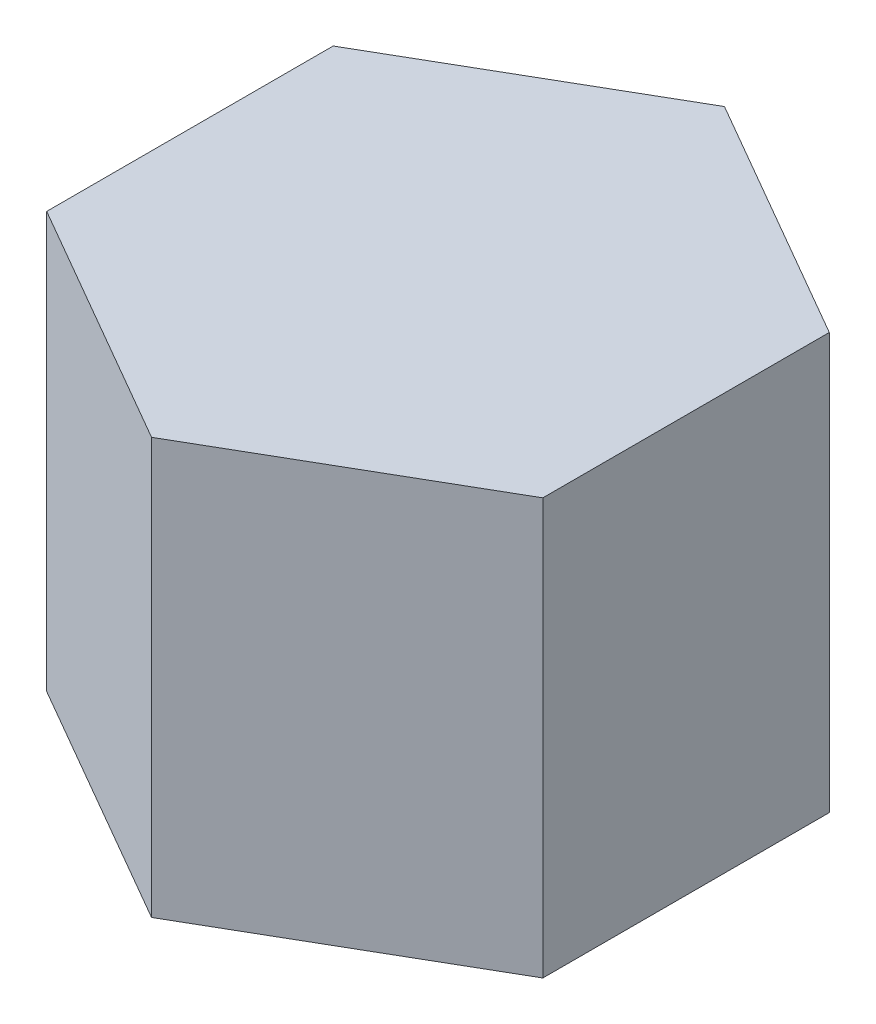
ISO-10303-21;
HEADER;
FILE_DESCRIPTION(('STEP AP214'),'2;1');
FILE_NAME('part.step','',(''),(''),'','','');
FILE_SCHEMA(('AUTOMOTIVE_DESIGN { 1 0 10303 214 1 1 1 1 }'));
ENDSEC;
DATA;
#1=APPLICATION_CONTEXT('core data for automotive mechanical design processes');
#2=APPLICATION_PROTOCOL_DEFINITION('international standard','automotive_design',2000,#1);
#3=PRODUCT_CONTEXT('',#1,'mechanical');
#4=PRODUCT('Part','Part','',(#3));
#5=PRODUCT_RELATED_PRODUCT_CATEGORY('part','',(#4));
#6=PRODUCT_DEFINITION_FORMATION('','',#4);
#7=PRODUCT_DEFINITION_CONTEXT('part definition',#1,'design');
#8=PRODUCT_DEFINITION('design','',#6,#7);
#9=PRODUCT_DEFINITION_SHAPE('','',#8);
#10=(LENGTH_UNIT() NAMED_UNIT(*) SI_UNIT(.MILLI.,.METRE.));
#11=(NAMED_UNIT(*) PLANE_ANGLE_UNIT() SI_UNIT($,.RADIAN.));
#12=(NAMED_UNIT(*) SI_UNIT($,.STERADIAN.) SOLID_ANGLE_UNIT());
#13=UNCERTAINTY_MEASURE_WITH_UNIT(LENGTH_MEASURE(1.E-05),#10,'distance_accuracy_value','');
#14=(GEOMETRIC_REPRESENTATION_CONTEXT(3) GLOBAL_UNCERTAINTY_ASSIGNED_CONTEXT((#13)) GLOBAL_UNIT_ASSIGNED_CONTEXT((#10,
#11,#12)) REPRESENTATION_CONTEXT('',''));
#15=CARTESIAN_POINT('',(0.,0.,0.));
#16=DIRECTION('',(0.,0.,1.));
#17=DIRECTION('',(1.,0.,0.));
#18=AXIS2_PLACEMENT_3D('',#15,#16,#17);
#19=CARTESIAN_POINT('',(202.142660308706,-148.537700895744,288.908895009141));
#20=DIRECTION('',(-0.499999999999943,0.,-0.866025403784472));
#21=DIRECTION('',(-0.866025403784472,0.,0.499999999999943));
#22=AXIS2_PLACEMENT_3D('',#19,#20,#21);
#23=PLANE('',#22);
#24=CARTESIAN_POINT('',(201.839551417382,-149.045793579175,289.083895009141));
#25=DIRECTION('',(0.866025403784471,0.,-0.499999999999943));
#26=VECTOR('',#25,1.);
#27=LINE('',#24,#26);
#28=CARTESIAN_POINT('',(201.839551417382,-149.045793579175,289.083895009141));
#29=VERTEX_POINT('',#28);
#30=CARTESIAN_POINT('',(202.142660308706,-149.045793579175,288.908895009141));
#31=VERTEX_POINT('',#30);
#32=EDGE_CURVE('E170',#29,#31,#27,.T.);
#33=ORIENTED_EDGE('',*,*,#32,.T.);
#34=CARTESIAN_POINT('',(202.142660308706,-148.537700895744,288.908895009141));
#35=DIRECTION('',(0.,-1.,0.));
#36=VECTOR('',#35,1.);
#37=LINE('',#34,#36);
#38=CARTESIAN_POINT('',(202.142660308706,-148.537700895744,288.908895009141));
#39=VERTEX_POINT('',#38);
#40=EDGE_CURVE('E35',#39,#31,#37,.T.);
#41=ORIENTED_EDGE('',*,*,#40,.F.);
#42=CARTESIAN_POINT('',(201.839551417382,-148.537700895744,289.083895009141));
#43=DIRECTION('',(0.866025403784471,0.,-0.499999999999943));
#44=VECTOR('',#43,1.);
#45=LINE('',#42,#44);
#46=CARTESIAN_POINT('',(201.839551417382,-148.537700895744,289.083895009141));
#47=VERTEX_POINT('',#46);
#48=EDGE_CURVE('E159',#47,#39,#45,.T.);
#49=ORIENTED_EDGE('',*,*,#48,.F.);
#50=CARTESIAN_POINT('',(201.839551417382,-148.537700895744,289.083895009141));
#51=DIRECTION('',(0.,-1.,0.));
#52=VECTOR('',#51,1.);
#53=LINE('',#50,#52);
#54=EDGE_CURVE('E10',#47,#29,#53,.T.);
#55=ORIENTED_EDGE('',*,*,#54,.T.);
#56=EDGE_LOOP('',(#33,#41,#49,#55));
#57=FACE_BOUND('',#56,.T.);
#58=ADVANCED_FACE('F16',(#57),#23,.F.);
#59=CARTESIAN_POINT('',(201.839551417382,-148.537700895744,289.083895009141));
#60=DIRECTION('',(0.500000000000062,0.,-0.866025403784403));
#61=DIRECTION('',(-0.866025403784403,0.,-0.500000000000062));
#62=AXIS2_PLACEMENT_3D('',#59,#60,#61);
#63=PLANE('',#62);
#64=CARTESIAN_POINT('',(201.536442526057,-149.045793579175,288.908895009141));
#65=DIRECTION('',(0.866025403784403,0.,0.500000000000062));
#66=VECTOR('',#65,1.);
#67=LINE('',#64,#66);
#68=CARTESIAN_POINT('',(201.536442526057,-149.045793579175,288.908895009141));
#69=VERTEX_POINT('',#68);
#70=EDGE_CURVE('E167',#69,#29,#67,.T.);
#71=ORIENTED_EDGE('',*,*,#70,.T.);
#72=ORIENTED_EDGE('',*,*,#54,.F.);
#73=CARTESIAN_POINT('',(201.536442526057,-148.537700895744,288.908895009141));
#74=DIRECTION('',(0.866025403784403,0.,0.500000000000062));
#75=VECTOR('',#74,1.);
#76=LINE('',#73,#75);
#77=CARTESIAN_POINT('',(201.536442526057,-148.537700895744,288.908895009141));
#78=VERTEX_POINT('',#77);
#79=EDGE_CURVE('E156',#78,#47,#76,.T.);
#80=ORIENTED_EDGE('',*,*,#79,.F.);
#81=CARTESIAN_POINT('',(201.536442526057,-148.537700895744,288.908895009141));
#82=DIRECTION('',(0.,-1.,0.));
#83=VECTOR('',#82,1.);
#84=LINE('',#81,#83);
#85=EDGE_CURVE('E27',#78,#69,#84,.T.);
#86=ORIENTED_EDGE('',*,*,#85,.T.);
#87=EDGE_LOOP('',(#71,#72,#80,#86));
#88=FACE_BOUND('',#87,.T.);
#89=ADVANCED_FACE('F189',(#88),#63,.F.);
#90=CARTESIAN_POINT('',(201.536442526057,-148.537700895744,290.831971220494));
#91=DIRECTION('',(1.,0.,0.));
#92=DIRECTION('',(0.,1.,0.));
#93=AXIS2_PLACEMENT_3D('',#90,#91,#92);
#94=PLANE('',#93);
#95=CARTESIAN_POINT('',(201.536442526057,-149.045793579175,288.558895009141));
#96=DIRECTION('',(0.,0.,1.));
#97=VECTOR('',#96,1.);
#98=LINE('',#95,#97);
#99=CARTESIAN_POINT('',(201.536442526057,-149.045793579175,288.558895009141));
#100=VERTEX_POINT('',#99);
#101=EDGE_CURVE('E163',#100,#69,#98,.T.);
#102=ORIENTED_EDGE('',*,*,#101,.T.);
#103=ORIENTED_EDGE('',*,*,#85,.F.);
#104=CARTESIAN_POINT('',(201.536442526057,-148.537700895744,288.558895009141));
#105=DIRECTION('',(0.,0.,1.));
#106=VECTOR('',#105,1.);
#107=LINE('',#104,#106);
#108=CARTESIAN_POINT('',(201.536442526057,-148.537700895744,288.558895009141));
#109=VERTEX_POINT('',#108);
#110=EDGE_CURVE('E106',#109,#78,#107,.T.);
#111=ORIENTED_EDGE('',*,*,#110,.F.);
#112=CARTESIAN_POINT('',(201.536442526057,-148.537700895744,288.558895009141));
#113=DIRECTION('',(0.,-1.,0.));
#114=VECTOR('',#113,1.);
#115=LINE('',#112,#114);
#116=EDGE_CURVE('E94',#109,#100,#115,.T.);
#117=ORIENTED_EDGE('',*,*,#116,.T.);
#118=EDGE_LOOP('',(#102,#103,#111,#117));
#119=FACE_BOUND('',#118,.T.);
#120=ADVANCED_FACE('F198',(#119),#94,.F.);
#121=CARTESIAN_POINT('',(201.536442526057,-148.537700895744,288.558895009141));
#122=DIRECTION('',(0.499999999999978,0.,0.866025403784452));
#123=DIRECTION('',(0.866025403784452,0.,-0.499999999999978));
#124=AXIS2_PLACEMENT_3D('',#121,#122,#123);
#125=PLANE('',#124);
#126=CARTESIAN_POINT('',(201.839551417382,-149.045793579175,288.383895009141));
#127=DIRECTION('',(-0.866025403784452,0.,0.499999999999978));
#128=VECTOR('',#127,1.);
#129=LINE('',#126,#128);
#130=CARTESIAN_POINT('',(201.839551417382,-149.045793579175,288.383895009141));
#131=VERTEX_POINT('',#130);
#132=EDGE_CURVE('E162',#131,#100,#129,.T.);
#133=ORIENTED_EDGE('',*,*,#132,.T.);
#134=ORIENTED_EDGE('',*,*,#116,.F.);
#135=CARTESIAN_POINT('',(201.839551417382,-148.537700895744,288.383895009141));
#136=DIRECTION('',(-0.866025403784452,0.,0.499999999999978));
#137=VECTOR('',#136,1.);
#138=LINE('',#135,#137);
#139=CARTESIAN_POINT('',(201.839551417382,-148.537700895744,288.383895009141));
#140=VERTEX_POINT('',#139);
#141=EDGE_CURVE('E98',#140,#109,#138,.T.);
#142=ORIENTED_EDGE('',*,*,#141,.F.);
#143=CARTESIAN_POINT('',(201.839551417382,-148.537700895744,288.383895009141));
#144=DIRECTION('',(0.,-1.,0.));
#145=VECTOR('',#144,1.);
#146=LINE('',#143,#145);
#147=EDGE_CURVE('E79',#140,#131,#146,.T.);
#148=ORIENTED_EDGE('',*,*,#147,.T.);
#149=EDGE_LOOP('',(#133,#134,#142,#148));
#150=FACE_BOUND('',#149,.T.);
#151=ADVANCED_FACE('F100',(#150),#125,.F.);
#152=CARTESIAN_POINT('',(201.839551417382,-148.537700895744,288.383895009141));
#153=DIRECTION('',(-0.499999999999978,0.,0.866025403784452));
#154=DIRECTION('',(0.866025403784452,0.,0.499999999999978));
#155=AXIS2_PLACEMENT_3D('',#152,#153,#154);
#156=PLANE('',#155);
#157=CARTESIAN_POINT('',(202.142660308706,-149.045793579175,288.558895009141));
#158=DIRECTION('',(-0.866025403784452,0.,-0.499999999999978));
#159=VECTOR('',#158,1.);
#160=LINE('',#157,#159);
#161=CARTESIAN_POINT('',(202.142660308706,-149.045793579175,288.558895009141));
#162=VERTEX_POINT('',#161);
#163=EDGE_CURVE('E88',#162,#131,#160,.T.);
#164=ORIENTED_EDGE('',*,*,#163,.T.);
#165=ORIENTED_EDGE('',*,*,#147,.F.);
#166=CARTESIAN_POINT('',(202.142660308706,-148.537700895744,288.558895009141));
#167=DIRECTION('',(-0.866025403784452,0.,-0.499999999999978));
#168=VECTOR('',#167,1.);
#169=LINE('',#166,#168);
#170=CARTESIAN_POINT('',(202.142660308706,-148.537700895744,288.558895009141));
#171=VERTEX_POINT('',#170);
#172=EDGE_CURVE('E84',#171,#140,#169,.T.);
#173=ORIENTED_EDGE('',*,*,#172,.F.);
#174=CARTESIAN_POINT('',(202.142660308706,-148.537700895744,288.558895009141));
#175=DIRECTION('',(0.,-1.,0.));
#176=VECTOR('',#175,1.);
#177=LINE('',#174,#176);
#178=EDGE_CURVE('E58',#171,#162,#177,.T.);
#179=ORIENTED_EDGE('',*,*,#178,.T.);
#180=EDGE_LOOP('',(#164,#165,#173,#179));
#181=FACE_BOUND('',#180,.T.);
#182=ADVANCED_FACE('F82',(#181),#156,.F.);
#183=CARTESIAN_POINT('',(202.142660308706,-148.537700895744,290.831971220494));
#184=DIRECTION('',(-1.,0.,0.));
#185=DIRECTION('',(0.,-1.,0.));
#186=AXIS2_PLACEMENT_3D('',#183,#184,#185);
#187=PLANE('',#186);
#188=CARTESIAN_POINT('',(202.142660308706,-149.045793579175,288.908895009141));
#189=DIRECTION('',(0.,0.,-1.));
#190=VECTOR('',#189,1.);
#191=LINE('',#188,#190);
#192=EDGE_CURVE('E160',#31,#162,#191,.T.);
#193=ORIENTED_EDGE('',*,*,#192,.T.);
#194=ORIENTED_EDGE('',*,*,#178,.F.);
#195=CARTESIAN_POINT('',(202.142660308706,-148.537700895744,288.908895009141));
#196=DIRECTION('',(0.,0.,-1.));
#197=VECTOR('',#196,1.);
#198=LINE('',#195,#197);
#199=EDGE_CURVE('E112',#39,#171,#198,.T.);
#200=ORIENTED_EDGE('',*,*,#199,.F.);
#201=ORIENTED_EDGE('',*,*,#40,.T.);
#202=EDGE_LOOP('',(#193,#194,#200,#201));
#203=FACE_BOUND('',#202,.T.);
#204=ADVANCED_FACE('F131',(#203),#187,.F.);
#205=CARTESIAN_POINT('',(206.339551417382,-148.537700895744,290.831971220494));
#206=DIRECTION('',(0.,-1.,0.));
#207=DIRECTION('',(1.,0.,0.));
#208=AXIS2_PLACEMENT_3D('',#205,#206,#207);
#209=PLANE('',#208);
#210=ORIENTED_EDGE('',*,*,#48,.T.);
#211=ORIENTED_EDGE('',*,*,#199,.T.);
#212=ORIENTED_EDGE('',*,*,#172,.T.);
#213=ORIENTED_EDGE('',*,*,#141,.T.);
#214=ORIENTED_EDGE('',*,*,#110,.T.);
#215=ORIENTED_EDGE('',*,*,#79,.T.);
#216=EDGE_LOOP('',(#210,#211,#212,#213,#214,#215));
#217=FACE_BOUND('',#216,.T.);
#218=ADVANCED_FACE('F111',(#217),#209,.F.);
#219=CARTESIAN_POINT('',(206.339551417382,-149.045793579175,290.831971220494));
#220=DIRECTION('',(0.,-1.,0.));
#221=DIRECTION('',(1.,0.,0.));
#222=AXIS2_PLACEMENT_3D('',#219,#220,#221);
#223=PLANE('',#222);
#224=ORIENTED_EDGE('',*,*,#32,.F.);
#225=ORIENTED_EDGE('',*,*,#70,.F.);
#226=ORIENTED_EDGE('',*,*,#101,.F.);
#227=ORIENTED_EDGE('',*,*,#132,.F.);
#228=ORIENTED_EDGE('',*,*,#163,.F.);
#229=ORIENTED_EDGE('',*,*,#192,.F.);
#230=EDGE_LOOP('',(#224,#225,#226,#227,#228,#229));
#231=FACE_BOUND('',#230,.T.);
#232=ADVANCED_FACE('F130',(#231),#223,.T.);
#233=CLOSED_SHELL('',(#58,#89,#120,#151,#182,#204,#218,#232));
#234=MANIFOLD_SOLID_BREP('B1',#233);
#235=ADVANCED_BREP_SHAPE_REPRESENTATION('',(#18,#234),#14);
#236=SHAPE_DEFINITION_REPRESENTATION(#9,#235);
ENDSEC;
END-ISO-10303-21;
